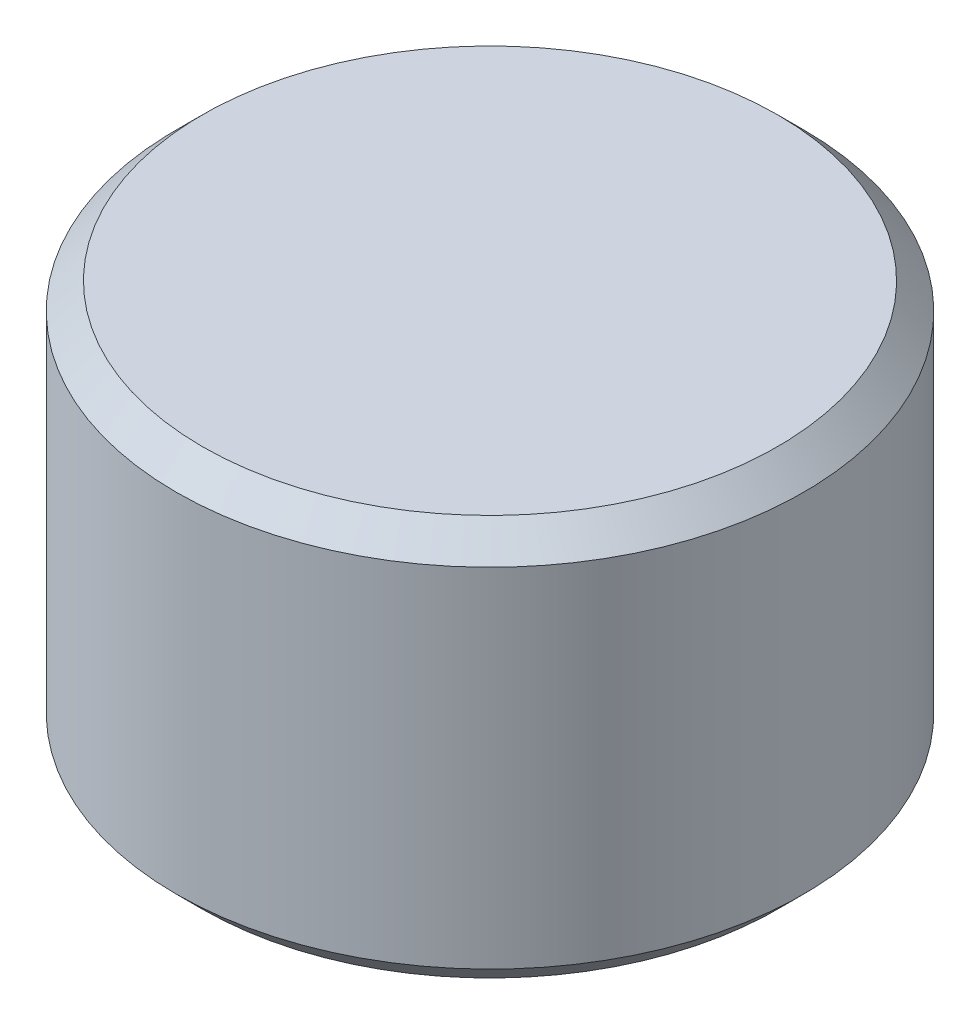
ISO-10303-21;
HEADER;
FILE_DESCRIPTION(('STEP AP214'),'2;1');
FILE_NAME('part.step','',(''),(''),'','','');
FILE_SCHEMA(('AUTOMOTIVE_DESIGN { 1 0 10303 214 1 1 1 1 }'));
ENDSEC;
DATA;
#1=APPLICATION_CONTEXT('core data for automotive mechanical design processes');
#2=APPLICATION_PROTOCOL_DEFINITION('international standard','automotive_design',2000,#1);
#3=PRODUCT_CONTEXT('',#1,'mechanical');
#4=PRODUCT('Part','Part','',(#3));
#5=PRODUCT_RELATED_PRODUCT_CATEGORY('part','',(#4));
#6=PRODUCT_DEFINITION_FORMATION('','',#4);
#7=PRODUCT_DEFINITION_CONTEXT('part definition',#1,'design');
#8=PRODUCT_DEFINITION('design','',#6,#7);
#9=PRODUCT_DEFINITION_SHAPE('','',#8);
#10=(LENGTH_UNIT() NAMED_UNIT(*) SI_UNIT(.MILLI.,.METRE.));
#11=(NAMED_UNIT(*) PLANE_ANGLE_UNIT() SI_UNIT($,.RADIAN.));
#12=(NAMED_UNIT(*) SI_UNIT($,.STERADIAN.) SOLID_ANGLE_UNIT());
#13=UNCERTAINTY_MEASURE_WITH_UNIT(LENGTH_MEASURE(1.E-05),#10,'distance_accuracy_value','');
#14=(GEOMETRIC_REPRESENTATION_CONTEXT(3) GLOBAL_UNCERTAINTY_ASSIGNED_CONTEXT((#13)) GLOBAL_UNIT_ASSIGNED_CONTEXT((#10,
#11,#12)) REPRESENTATION_CONTEXT('',''));
#15=CARTESIAN_POINT('',(0.,0.,0.));
#16=DIRECTION('',(0.,0.,1.));
#17=DIRECTION('',(1.,0.,0.));
#18=AXIS2_PLACEMENT_3D('',#15,#16,#17);
#19=CARTESIAN_POINT('',(0.,1524.,0.));
#20=DIRECTION('',(0.,-1.,0.));
#21=DIRECTION('',(0.,0.,-1.));
#22=AXIS2_PLACEMENT_3D('',#19,#20,#21);
#23=CYLINDRICAL_SURFACE('',#22,1193.8);
#24=CARTESIAN_POINT('',(0.,99.9999999999996,0.));
#25=DIRECTION('',(0.,1.,0.));
#26=DIRECTION('',(0.,0.,1.));
#27=AXIS2_PLACEMENT_3D('',#24,#25,#26);
#28=CIRCLE('',#27,1193.8);
#29=CARTESIAN_POINT('',(0.,99.9999999999996,1193.8));
#30=VERTEX_POINT('',#29);
#31=EDGE_CURVE('E41',#30,#30,#28,.T.);
#32=ORIENTED_EDGE('',*,*,#31,.T.);
#33=EDGE_LOOP('',(#32));
#34=FACE_BOUND('',#33,.T.);
#35=CARTESIAN_POINT('',(0.,1424.,0.));
#36=DIRECTION('',(0.,1.,0.));
#37=DIRECTION('',(0.,0.,1.));
#38=AXIS2_PLACEMENT_3D('',#35,#36,#37);
#39=CIRCLE('',#38,1193.8);
#40=CARTESIAN_POINT('',(0.,1424.,1193.8));
#41=VERTEX_POINT('',#40);
#42=EDGE_CURVE('E45',#41,#41,#39,.F.);
#43=ORIENTED_EDGE('',*,*,#42,.T.);
#44=EDGE_LOOP('',(#43));
#45=FACE_BOUND('',#44,.T.);
#46=ADVANCED_FACE('F33',(#34,#45),#23,.T.);
#47=CARTESIAN_POINT('',(0.,1524.,0.));
#48=DIRECTION('',(0.,1.,0.));
#49=DIRECTION('',(0.,0.,1.));
#50=AXIS2_PLACEMENT_3D('',#47,#48,#49);
#51=PLANE('',#50);
#52=CARTESIAN_POINT('',(0.,1524.,0.));
#53=DIRECTION('',(0.,1.,0.));
#54=DIRECTION('',(0.,0.,1.));
#55=AXIS2_PLACEMENT_3D('',#52,#53,#54);
#56=CIRCLE('',#55,1093.8);
#57=CARTESIAN_POINT('',(0.,1524.,1093.8));
#58=VERTEX_POINT('',#57);
#59=EDGE_CURVE('E49',#58,#58,#56,.T.);
#60=ORIENTED_EDGE('',*,*,#59,.T.);
#61=EDGE_LOOP('',(#60));
#62=FACE_BOUND('',#61,.T.);
#63=ADVANCED_FACE('F55',(#62),#51,.T.);
#64=CARTESIAN_POINT('',(0.,0.,0.));
#65=DIRECTION('',(0.,1.,0.));
#66=DIRECTION('',(0.,0.,1.));
#67=AXIS2_PLACEMENT_3D('',#64,#65,#66);
#68=PLANE('',#67);
#69=CARTESIAN_POINT('',(0.,0.,0.));
#70=DIRECTION('',(0.,1.,0.));
#71=DIRECTION('',(0.,0.,1.));
#72=AXIS2_PLACEMENT_3D('',#69,#70,#71);
#73=CIRCLE('',#72,1093.8);
#74=CARTESIAN_POINT('',(0.,0.,1093.8));
#75=VERTEX_POINT('',#74);
#76=EDGE_CURVE('E10',#75,#75,#73,.F.);
#77=ORIENTED_EDGE('',*,*,#76,.T.);
#78=EDGE_LOOP('',(#77));
#79=FACE_BOUND('',#78,.T.);
#80=ADVANCED_FACE('F59',(#79),#68,.F.);
#81=CARTESIAN_POINT('',(0.,1524.,0.));
#82=DIRECTION('',(0.,-1.,0.));
#83=DIRECTION('',(0.,0.,-1.));
#84=AXIS2_PLACEMENT_3D('',#81,#82,#83);
#85=CONICAL_SURFACE('',#84,1093.8,0.785398163397445);
#86=ORIENTED_EDGE('',*,*,#42,.F.);
#87=EDGE_LOOP('',(#86));
#88=FACE_BOUND('',#87,.T.);
#89=ORIENTED_EDGE('',*,*,#59,.F.);
#90=EDGE_LOOP('',(#89));
#91=FACE_BOUND('',#90,.T.);
#92=ADVANCED_FACE('F57',(#88,#91),#85,.T.);
#93=CARTESIAN_POINT('',(0.,99.9999999999996,0.));
#94=DIRECTION('',(0.,1.,0.));
#95=DIRECTION('',(0.,0.,1.));
#96=AXIS2_PLACEMENT_3D('',#93,#94,#95);
#97=CONICAL_SURFACE('',#96,1193.8,0.785398163397448);
#98=ORIENTED_EDGE('',*,*,#76,.F.);
#99=EDGE_LOOP('',(#98));
#100=FACE_BOUND('',#99,.T.);
#101=ORIENTED_EDGE('',*,*,#31,.F.);
#102=EDGE_LOOP('',(#101));
#103=FACE_BOUND('',#102,.T.);
#104=ADVANCED_FACE('F36',(#100,#103),#97,.T.);
#105=CLOSED_SHELL('',(#46,#63,#80,#92,#104));
#106=MANIFOLD_SOLID_BREP('B2',#105);
#107=ADVANCED_BREP_SHAPE_REPRESENTATION('',(#18,#106),#14);
#108=SHAPE_DEFINITION_REPRESENTATION(#9,#107);
ENDSEC;
END-ISO-10303-21;
